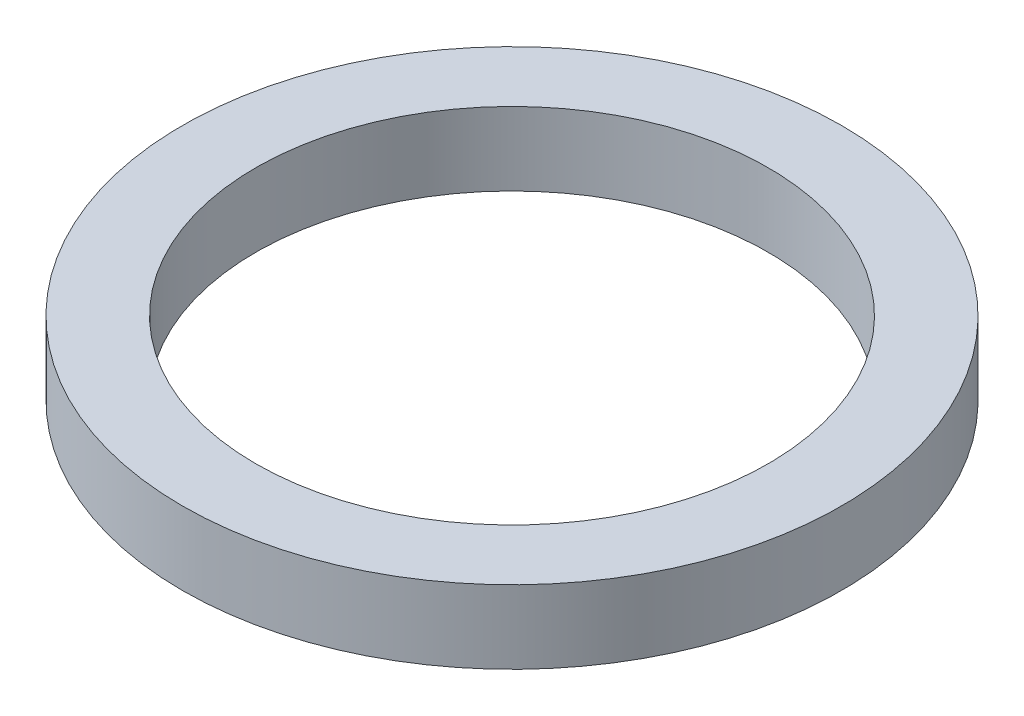
ISO-10303-21;
HEADER;
FILE_DESCRIPTION(('STEP AP214'),'2;1');
FILE_NAME('part.step','',(''),(''),'','','');
FILE_SCHEMA(('AUTOMOTIVE_DESIGN { 1 0 10303 214 1 1 1 1 }'));
ENDSEC;
DATA;
#1=APPLICATION_CONTEXT('core data for automotive mechanical design processes');
#2=APPLICATION_PROTOCOL_DEFINITION('international standard','automotive_design',2000,#1);
#3=PRODUCT_CONTEXT('',#1,'mechanical');
#4=PRODUCT('Part','Part','',(#3));
#5=PRODUCT_RELATED_PRODUCT_CATEGORY('part','',(#4));
#6=PRODUCT_DEFINITION_FORMATION('','',#4);
#7=PRODUCT_DEFINITION_CONTEXT('part definition',#1,'design');
#8=PRODUCT_DEFINITION('design','',#6,#7);
#9=PRODUCT_DEFINITION_SHAPE('','',#8);
#10=(LENGTH_UNIT() NAMED_UNIT(*) SI_UNIT(.MILLI.,.METRE.));
#11=(NAMED_UNIT(*) PLANE_ANGLE_UNIT() SI_UNIT($,.RADIAN.));
#12=(NAMED_UNIT(*) SI_UNIT($,.STERADIAN.) SOLID_ANGLE_UNIT());
#13=UNCERTAINTY_MEASURE_WITH_UNIT(LENGTH_MEASURE(1.E-05),#10,'distance_accuracy_value','');
#14=(GEOMETRIC_REPRESENTATION_CONTEXT(3) GLOBAL_UNCERTAINTY_ASSIGNED_CONTEXT((#13)) GLOBAL_UNIT_ASSIGNED_CONTEXT((#10,
#11,#12)) REPRESENTATION_CONTEXT('',''));
#15=CARTESIAN_POINT('',(0.,0.,0.));
#16=DIRECTION('',(0.,0.,1.));
#17=DIRECTION('',(1.,0.,0.));
#18=AXIS2_PLACEMENT_3D('',#15,#16,#17);
#19=CARTESIAN_POINT('',(0.,10.,0.));
#20=DIRECTION('',(0.,-1.,0.));
#21=DIRECTION('',(0.,0.,-1.));
#22=AXIS2_PLACEMENT_3D('',#19,#20,#21);
#23=CYLINDRICAL_SURFACE('',#22,45.);
#24=CARTESIAN_POINT('',(0.,10.,0.));
#25=DIRECTION('',(0.,1.,0.));
#26=DIRECTION('',(0.,0.,1.));
#27=AXIS2_PLACEMENT_3D('',#24,#25,#26);
#28=CIRCLE('',#27,45.);
#29=CARTESIAN_POINT('',(0.,10.,45.));
#30=VERTEX_POINT('',#29);
#31=EDGE_CURVE('E10',#30,#30,#28,.T.);
#32=ORIENTED_EDGE('',*,*,#31,.F.);
#33=EDGE_LOOP('',(#32));
#34=FACE_BOUND('',#33,.T.);
#35=CARTESIAN_POINT('',(0.,0.,0.));
#36=DIRECTION('',(0.,1.,0.));
#37=DIRECTION('',(0.,0.,1.));
#38=AXIS2_PLACEMENT_3D('',#35,#36,#37);
#39=CIRCLE('',#38,45.);
#40=CARTESIAN_POINT('',(0.,0.,45.));
#41=VERTEX_POINT('',#40);
#42=EDGE_CURVE('E37',#41,#41,#39,.T.);
#43=ORIENTED_EDGE('',*,*,#42,.T.);
#44=EDGE_LOOP('',(#43));
#45=FACE_BOUND('',#44,.T.);
#46=ADVANCED_FACE('F40',(#34,#45),#23,.T.);
#47=CARTESIAN_POINT('',(0.,10.,0.));
#48=DIRECTION('',(0.,1.,0.));
#49=DIRECTION('',(0.,0.,1.));
#50=AXIS2_PLACEMENT_3D('',#47,#48,#49);
#51=PLANE('',#50);
#52=CARTESIAN_POINT('',(0.,10.,0.));
#53=DIRECTION('',(0.,1.,0.));
#54=DIRECTION('',(0.,0.,1.));
#55=AXIS2_PLACEMENT_3D('',#52,#53,#54);
#56=CIRCLE('',#55,35.);
#57=CARTESIAN_POINT('',(0.,10.,35.));
#58=VERTEX_POINT('',#57);
#59=EDGE_CURVE('E50',#58,#58,#56,.T.);
#60=ORIENTED_EDGE('',*,*,#59,.F.);
#61=EDGE_LOOP('',(#60));
#62=FACE_BOUND('',#61,.T.);
#63=ORIENTED_EDGE('',*,*,#31,.T.);
#64=EDGE_LOOP('',(#63));
#65=FACE_BOUND('',#64,.T.);
#66=ADVANCED_FACE('F59',(#62,#65),#51,.T.);
#67=CARTESIAN_POINT('',(0.,0.,0.));
#68=DIRECTION('',(0.,1.,0.));
#69=DIRECTION('',(0.,0.,1.));
#70=AXIS2_PLACEMENT_3D('',#67,#68,#69);
#71=PLANE('',#70);
#72=CARTESIAN_POINT('',(0.,0.,0.));
#73=DIRECTION('',(0.,1.,0.));
#74=DIRECTION('',(0.,0.,1.));
#75=AXIS2_PLACEMENT_3D('',#72,#73,#74);
#76=CIRCLE('',#75,35.);
#77=CARTESIAN_POINT('',(0.,0.,35.));
#78=VERTEX_POINT('',#77);
#79=EDGE_CURVE('E47',#78,#78,#76,.T.);
#80=ORIENTED_EDGE('',*,*,#79,.T.);
#81=EDGE_LOOP('',(#80));
#82=FACE_BOUND('',#81,.T.);
#83=ORIENTED_EDGE('',*,*,#42,.F.);
#84=EDGE_LOOP('',(#83));
#85=FACE_BOUND('',#84,.T.);
#86=ADVANCED_FACE('F58',(#82,#85),#71,.F.);
#87=CARTESIAN_POINT('',(0.,10.,0.));
#88=DIRECTION('',(0.,-1.,0.));
#89=DIRECTION('',(0.,0.,-1.));
#90=AXIS2_PLACEMENT_3D('',#87,#88,#89);
#91=CYLINDRICAL_SURFACE('',#90,35.);
#92=ORIENTED_EDGE('',*,*,#59,.T.);
#93=EDGE_LOOP('',(#92));
#94=FACE_BOUND('',#93,.T.);
#95=ORIENTED_EDGE('',*,*,#79,.F.);
#96=EDGE_LOOP('',(#95));
#97=FACE_BOUND('',#96,.T.);
#98=ADVANCED_FACE('F54',(#94,#97),#91,.F.);
#99=CLOSED_SHELL('',(#46,#66,#86,#98));
#100=MANIFOLD_SOLID_BREP('B2',#99);
#101=ADVANCED_BREP_SHAPE_REPRESENTATION('',(#18,#100),#14);
#102=SHAPE_DEFINITION_REPRESENTATION(#9,#101);
ENDSEC;
END-ISO-10303-21;
